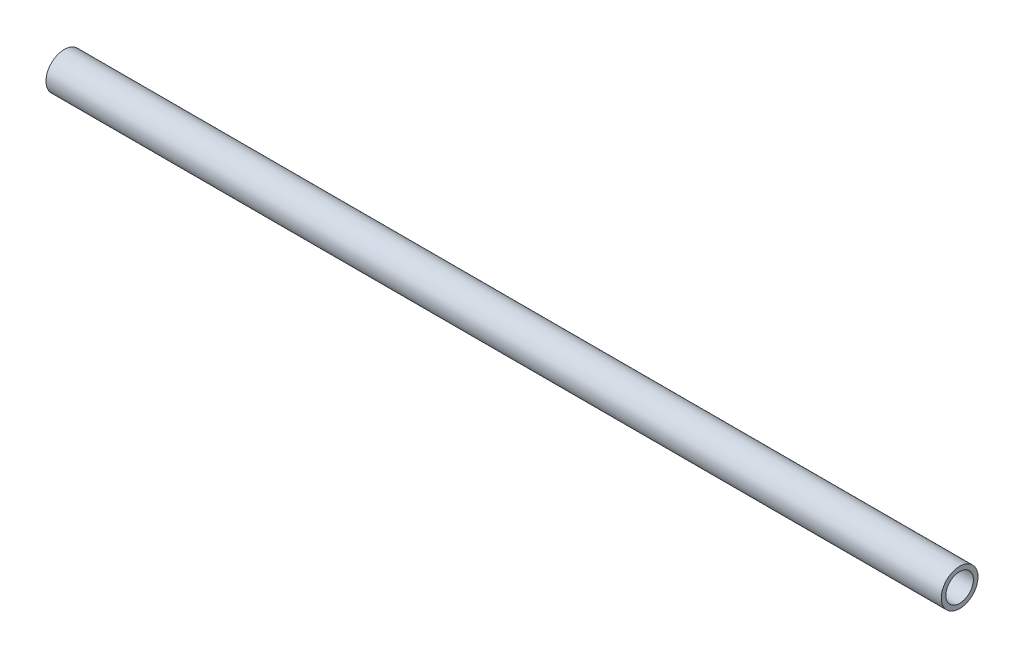
ISO-10303-21;
HEADER;
FILE_DESCRIPTION(('STEP AP214'),'2;1');
FILE_NAME('part.step','',(''),(''),'','','');
FILE_SCHEMA(('AUTOMOTIVE_DESIGN { 1 0 10303 214 1 1 1 1 }'));
ENDSEC;
DATA;
#1=APPLICATION_CONTEXT('core data for automotive mechanical design processes');
#2=APPLICATION_PROTOCOL_DEFINITION('international standard','automotive_design',2000,#1);
#3=PRODUCT_CONTEXT('',#1,'mechanical');
#4=PRODUCT('Part','Part','',(#3));
#5=PRODUCT_RELATED_PRODUCT_CATEGORY('part','',(#4));
#6=PRODUCT_DEFINITION_FORMATION('','',#4);
#7=PRODUCT_DEFINITION_CONTEXT('part definition',#1,'design');
#8=PRODUCT_DEFINITION('design','',#6,#7);
#9=PRODUCT_DEFINITION_SHAPE('','',#8);
#10=(LENGTH_UNIT() NAMED_UNIT(*) SI_UNIT(.MILLI.,.METRE.));
#11=(NAMED_UNIT(*) PLANE_ANGLE_UNIT() SI_UNIT($,.RADIAN.));
#12=(NAMED_UNIT(*) SI_UNIT($,.STERADIAN.) SOLID_ANGLE_UNIT());
#13=UNCERTAINTY_MEASURE_WITH_UNIT(LENGTH_MEASURE(1.E-05),#10,'distance_accuracy_value','');
#14=(GEOMETRIC_REPRESENTATION_CONTEXT(3) GLOBAL_UNCERTAINTY_ASSIGNED_CONTEXT((#13)) GLOBAL_UNIT_ASSIGNED_CONTEXT((#10,
#11,#12)) REPRESENTATION_CONTEXT('',''));
#15=CARTESIAN_POINT('',(0.,0.,0.));
#16=DIRECTION('',(0.,0.,1.));
#17=DIRECTION('',(1.,0.,0.));
#18=AXIS2_PLACEMENT_3D('',#15,#16,#17);
#19=CARTESIAN_POINT('',(309.5625,0.,0.));
#20=DIRECTION('',(1.,0.,0.));
#21=DIRECTION('',(0.,0.,-1.));
#22=AXIS2_PLACEMENT_3D('',#19,#20,#21);
#23=PLANE('',#22);
#24=CARTESIAN_POINT('',(309.5625,0.,0.));
#25=DIRECTION('',(1.,0.,0.));
#26=DIRECTION('',(0.,0.,-1.));
#27=AXIS2_PLACEMENT_3D('',#24,#25,#26);
#28=CIRCLE('',#27,12.7);
#29=CARTESIAN_POINT('',(309.5625,0.,-12.7));
#30=VERTEX_POINT('',#29);
#31=EDGE_CURVE('E10',#30,#30,#28,.T.);
#32=ORIENTED_EDGE('',*,*,#31,.T.);
#33=EDGE_LOOP('',(#32));
#34=FACE_BOUND('',#33,.T.);
#35=CARTESIAN_POINT('',(309.5625,0.,0.));
#36=DIRECTION('',(1.,0.,0.));
#37=DIRECTION('',(0.,0.,-1.));
#38=AXIS2_PLACEMENT_3D('',#35,#36,#37);
#39=CIRCLE('',#38,9.525);
#40=CARTESIAN_POINT('',(309.5625,0.,-9.525));
#41=VERTEX_POINT('',#40);
#42=EDGE_CURVE('E42',#41,#41,#39,.T.);
#43=ORIENTED_EDGE('',*,*,#42,.F.);
#44=EDGE_LOOP('',(#43));
#45=FACE_BOUND('',#44,.T.);
#46=ADVANCED_FACE('F31',(#34,#45),#23,.T.);
#47=CARTESIAN_POINT('',(-309.5625,0.,0.));
#48=DIRECTION('',(1.,0.,0.));
#49=DIRECTION('',(0.,0.,-1.));
#50=AXIS2_PLACEMENT_3D('',#47,#48,#49);
#51=PLANE('',#50);
#52=CARTESIAN_POINT('',(-309.5625,0.,0.));
#53=DIRECTION('',(1.,0.,0.));
#54=DIRECTION('',(0.,0.,-1.));
#55=AXIS2_PLACEMENT_3D('',#52,#53,#54);
#56=CIRCLE('',#55,12.7);
#57=CARTESIAN_POINT('',(-309.5625,0.,-12.7));
#58=VERTEX_POINT('',#57);
#59=EDGE_CURVE('E35',#58,#58,#56,.T.);
#60=ORIENTED_EDGE('',*,*,#59,.F.);
#61=EDGE_LOOP('',(#60));
#62=FACE_BOUND('',#61,.T.);
#63=CARTESIAN_POINT('',(-309.5625,0.,0.));
#64=DIRECTION('',(1.,0.,0.));
#65=DIRECTION('',(0.,0.,-1.));
#66=AXIS2_PLACEMENT_3D('',#63,#64,#65);
#67=CIRCLE('',#66,9.525);
#68=CARTESIAN_POINT('',(-309.5625,0.,-9.525));
#69=VERTEX_POINT('',#68);
#70=EDGE_CURVE('E44',#69,#69,#67,.T.);
#71=ORIENTED_EDGE('',*,*,#70,.T.);
#72=EDGE_LOOP('',(#71));
#73=FACE_BOUND('',#72,.T.);
#74=ADVANCED_FACE('F54',(#62,#73),#51,.F.);
#75=CARTESIAN_POINT('',(309.5625,0.,0.));
#76=DIRECTION('',(-1.,0.,0.));
#77=DIRECTION('',(0.,0.,1.));
#78=AXIS2_PLACEMENT_3D('',#75,#76,#77);
#79=CYLINDRICAL_SURFACE('',#78,12.7);
#80=ORIENTED_EDGE('',*,*,#31,.F.);
#81=EDGE_LOOP('',(#80));
#82=FACE_BOUND('',#81,.T.);
#83=ORIENTED_EDGE('',*,*,#59,.T.);
#84=EDGE_LOOP('',(#83));
#85=FACE_BOUND('',#84,.T.);
#86=ADVANCED_FACE('F33',(#82,#85),#79,.T.);
#87=CARTESIAN_POINT('',(309.5625,0.,0.));
#88=DIRECTION('',(-1.,0.,0.));
#89=DIRECTION('',(0.,0.,1.));
#90=AXIS2_PLACEMENT_3D('',#87,#88,#89);
#91=CYLINDRICAL_SURFACE('',#90,9.525);
#92=ORIENTED_EDGE('',*,*,#42,.T.);
#93=EDGE_LOOP('',(#92));
#94=FACE_BOUND('',#93,.T.);
#95=ORIENTED_EDGE('',*,*,#70,.F.);
#96=EDGE_LOOP('',(#95));
#97=FACE_BOUND('',#96,.T.);
#98=ADVANCED_FACE('F50',(#94,#97),#91,.F.);
#99=CLOSED_SHELL('',(#46,#74,#86,#98));
#100=MANIFOLD_SOLID_BREP('B2',#99);
#101=ADVANCED_BREP_SHAPE_REPRESENTATION('',(#18,#100),#14);
#102=SHAPE_DEFINITION_REPRESENTATION(#9,#101);
ENDSEC;
END-ISO-10303-21;
